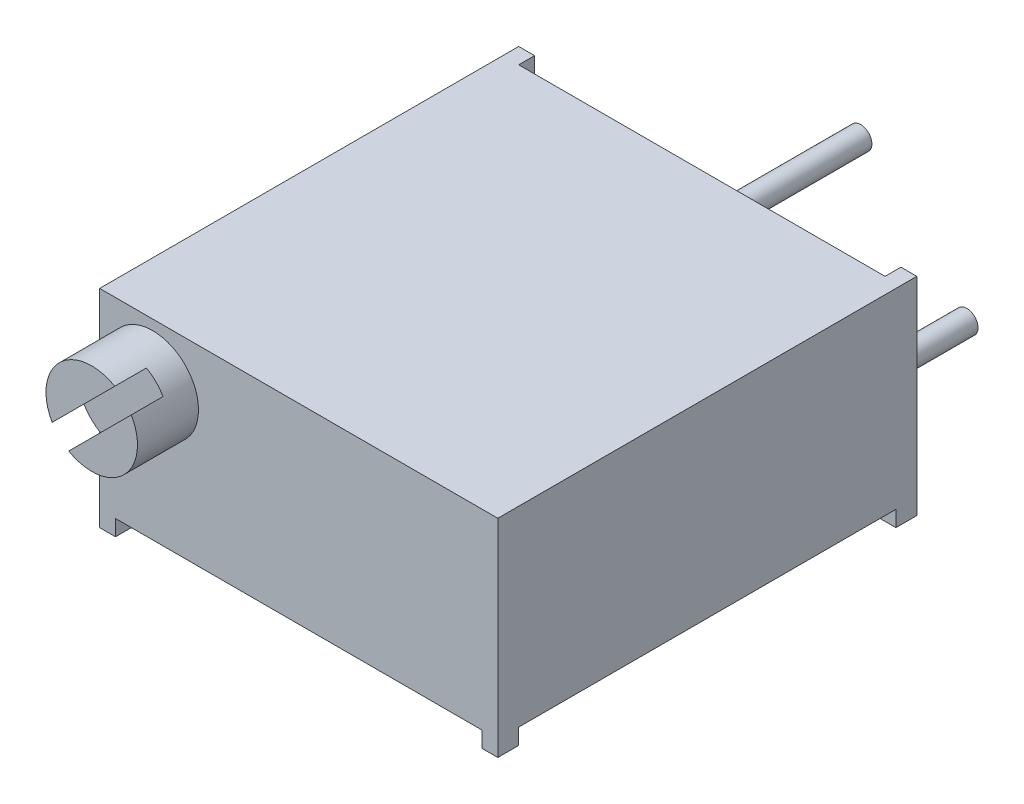
ISO-10303-21;
HEADER;
FILE_DESCRIPTION(('STEP AP214'),'2;1');
FILE_NAME('part.step','',(''),(''),'','','');
FILE_SCHEMA(('AUTOMOTIVE_DESIGN { 1 0 10303 214 1 1 1 1 }'));
ENDSEC;
DATA;
#1=APPLICATION_CONTEXT('core data for automotive mechanical design processes');
#2=APPLICATION_PROTOCOL_DEFINITION('international standard','automotive_design',2000,#1);
#3=PRODUCT_CONTEXT('',#1,'mechanical');
#4=PRODUCT('Part','Part','',(#3));
#5=PRODUCT_RELATED_PRODUCT_CATEGORY('part','',(#4));
#6=PRODUCT_DEFINITION_FORMATION('','',#4);
#7=PRODUCT_DEFINITION_CONTEXT('part definition',#1,'design');
#8=PRODUCT_DEFINITION('design','',#6,#7);
#9=PRODUCT_DEFINITION_SHAPE('','',#8);
#10=(LENGTH_UNIT() NAMED_UNIT(*) SI_UNIT(.MILLI.,.METRE.));
#11=(NAMED_UNIT(*) PLANE_ANGLE_UNIT() SI_UNIT($,.RADIAN.));
#12=(NAMED_UNIT(*) SI_UNIT($,.STERADIAN.) SOLID_ANGLE_UNIT());
#13=UNCERTAINTY_MEASURE_WITH_UNIT(LENGTH_MEASURE(1.E-05),#10,'distance_accuracy_value','');
#14=(GEOMETRIC_REPRESENTATION_CONTEXT(3) GLOBAL_UNCERTAINTY_ASSIGNED_CONTEXT((#13)) GLOBAL_UNIT_ASSIGNED_CONTEXT((#10,
#11,#12)) REPRESENTATION_CONTEXT('',''));
#15=CARTESIAN_POINT('',(0.,0.,0.));
#16=DIRECTION('',(0.,0.,1.));
#17=DIRECTION('',(1.,0.,0.));
#18=AXIS2_PLACEMENT_3D('',#15,#16,#17);
#19=CARTESIAN_POINT('',(-2.837,-1.567,-3.42));
#20=DIRECTION('',(0.,0.,1.));
#21=DIRECTION('',(1.,0.,0.));
#22=AXIS2_PLACEMENT_3D('',#19,#20,#21);
#23=PLANE('',#22);
#24=CARTESIAN_POINT('',(-2.54,-1.27,-3.42));
#25=DIRECTION('',(0.,0.,-1.));
#26=DIRECTION('',(-1.,0.,0.));
#27=AXIS2_PLACEMENT_3D('',#24,#25,#26);
#28=CIRCLE('',#27,0.27);
#29=CARTESIAN_POINT('',(-2.81,-1.27,-3.42));
#30=VERTEX_POINT('',#29);
#31=EDGE_CURVE('P0_E26',#30,#30,#28,.F.);
#32=ORIENTED_EDGE('',*,*,#31,.F.);
#33=EDGE_LOOP('',(#32));
#34=FACE_BOUND('',#33,.T.);
#35=ADVANCED_FACE('P0_F23',(#34),#23,.F.);
#36=CARTESIAN_POINT('',(-2.837,-1.567,0.38));
#37=DIRECTION('',(0.,0.,1.));
#38=DIRECTION('',(1.,0.,0.));
#39=AXIS2_PLACEMENT_3D('',#36,#37,#38);
#40=PLANE('',#39);
#41=CARTESIAN_POINT('',(-2.54,-1.27,0.38));
#42=DIRECTION('',(0.,0.,-1.));
#43=DIRECTION('',(-1.,0.,0.));
#44=AXIS2_PLACEMENT_3D('',#41,#42,#43);
#45=CIRCLE('',#44,0.27);
#46=CARTESIAN_POINT('',(-2.81,-1.27,0.38));
#47=VERTEX_POINT('',#46);
#48=EDGE_CURVE('P0_E12',#47,#47,#45,.T.);
#49=ORIENTED_EDGE('',*,*,#48,.F.);
#50=EDGE_LOOP('',(#49));
#51=FACE_BOUND('',#50,.T.);
#52=ADVANCED_FACE('P0_F38',(#51),#40,.T.);
#53=CARTESIAN_POINT('',(-2.54,-1.27,0.57));
#54=DIRECTION('',(0.,0.,-1.));
#55=DIRECTION('',(-1.,0.,0.));
#56=AXIS2_PLACEMENT_3D('',#53,#54,#55);
#57=CYLINDRICAL_SURFACE('',#56,0.27);
#58=ORIENTED_EDGE('',*,*,#31,.T.);
#59=EDGE_LOOP('',(#58));
#60=FACE_BOUND('',#59,.T.);
#61=ORIENTED_EDGE('',*,*,#48,.T.);
#62=EDGE_LOOP('',(#61));
#63=FACE_BOUND('',#62,.T.);
#64=ADVANCED_FACE('P0_F35',(#60,#63),#57,.T.);
#65=CLOSED_SHELL('',(#35,#52,#64));
#66=MANIFOLD_SOLID_BREP('P0_B1',#65);
#67=CARTESIAN_POINT('',(-4.487569568086,0.495781026712,11.49));
#68=DIRECTION('',(0.,0.,1.));
#69=DIRECTION('',(1.,0.,0.));
#70=AXIS2_PLACEMENT_3D('',#67,#68,#69);
#71=PLANE('',#70);
#72=DIRECTION('',(0.707106781186548,0.707106781186548,0.));
#73=VECTOR('',#72,1.);
#74=CARTESIAN_POINT('',(-4.516384169419,0.524595628045,11.49));
#75=LINE('',#74,#73);
#76=CARTESIAN_POINT('',(-2.94444965265297,2.09653014481103,11.49));
#77=VERTEX_POINT('',#76);
#78=CARTESIAN_POINT('',(-4.44153014481103,0.599449652652973,11.49));
#79=VERTEX_POINT('',#78);
#80=EDGE_CURVE('P1_E64',#77,#79,#75,.F.);
#81=ORIENTED_EDGE('',*,*,#80,.F.);
#82=CARTESIAN_POINT('',(-3.495,1.15,11.49));
#83=DIRECTION('',(0.,0.,1.));
#84=DIRECTION('',(1.,0.,0.));
#85=AXIS2_PLACEMENT_3D('',#82,#83,#84);
#86=CIRCLE('',#85,1.095);
#87=EDGE_CURVE('P1_E28',#77,#79,#86,.T.);
#88=ORIENTED_EDGE('',*,*,#87,.T.);
#89=EDGE_LOOP('',(#81,#88));
#90=FACE_BOUND('',#89,.T.);
#91=ADVANCED_FACE('P1_F25',(#90),#71,.T.);
#92=CARTESIAN_POINT('',(-4.516384169419,0.524595628045,11.528));
#93=DIRECTION('',(0.707106781186548,-0.707106781186548,0.));
#94=DIRECTION('',(0.707106781186548,0.707106781186548,0.));
#95=AXIS2_PLACEMENT_3D('',#92,#93,#94);
#96=PLANE('',#95);
#97=DIRECTION('',(-0.707106781186547,-0.707106781186548,0.));
#98=VECTOR('',#97,1.);
#99=CARTESIAN_POINT('',(-2.944449652653,2.096530144811,10.73));
#100=LINE('',#99,#98);
#101=CARTESIAN_POINT('',(-2.94444965265297,2.09653014481103,10.73));
#102=VERTEX_POINT('',#101);
#103=CARTESIAN_POINT('',(-4.44153014481103,0.599449652652973,10.73));
#104=VERTEX_POINT('',#103);
#105=EDGE_CURVE('P1_E84',#102,#104,#100,.T.);
#106=ORIENTED_EDGE('',*,*,#105,.F.);
#107=DIRECTION('',(0.,0.,1.));
#108=VECTOR('',#107,1.);
#109=CARTESIAN_POINT('',(-2.944449652653,2.096530144811,11.528));
#110=LINE('',#109,#108);
#111=EDGE_CURVE('P1_E74',#102,#77,#110,.T.);
#112=ORIENTED_EDGE('',*,*,#111,.T.);
#113=ORIENTED_EDGE('',*,*,#80,.T.);
#114=DIRECTION('',(0.,0.,1.));
#115=VECTOR('',#114,1.);
#116=CARTESIAN_POINT('',(-4.441530144811,0.599449652653001,11.528));
#117=LINE('',#116,#115);
#118=EDGE_CURVE('P1_E67',#79,#104,#117,.F.);
#119=ORIENTED_EDGE('',*,*,#118,.T.);
#120=EDGE_LOOP('',(#106,#112,#113,#119));
#121=FACE_BOUND('',#120,.T.);
#122=ADVANCED_FACE('P1_F76',(#121),#96,.T.);
#123=CARTESIAN_POINT('',(-3.495,-0.553420235878,10.73));
#124=DIRECTION('',(0.,0.,1.));
#125=DIRECTION('',(1.,0.,0.));
#126=AXIS2_PLACEMENT_3D('',#123,#124,#125);
#127=PLANE('',#126);
#128=DIRECTION('',(-0.707106781186548,-0.707106781186548,0.));
#129=VECTOR('',#128,1.);
#130=CARTESIAN_POINT('',(-4.120404371955,0.128615830581,10.73));
#131=LINE('',#130,#129);
#132=CARTESIAN_POINT('',(-2.54846985518897,1.70055034734703,10.73));
#133=VERTEX_POINT('',#132);
#134=CARTESIAN_POINT('',(-4.04555034734703,0.203469855188973,10.73));
#135=VERTEX_POINT('',#134);
#136=EDGE_CURVE('P1_E89',#133,#135,#131,.T.);
#137=ORIENTED_EDGE('',*,*,#136,.F.);
#138=CARTESIAN_POINT('',(-3.495,1.15,10.73));
#139=DIRECTION('',(0.,0.,1.));
#140=DIRECTION('',(1.,0.,0.));
#141=AXIS2_PLACEMENT_3D('',#138,#139,#140);
#142=CIRCLE('',#141,1.095);
#143=EDGE_CURVE('P1_E82',#133,#102,#142,.T.);
#144=ORIENTED_EDGE('',*,*,#143,.T.);
#145=ORIENTED_EDGE('',*,*,#105,.T.);
#146=CARTESIAN_POINT('',(-3.495,1.15,10.73));
#147=DIRECTION('',(0.,0.,1.));
#148=DIRECTION('',(1.,0.,0.));
#149=AXIS2_PLACEMENT_3D('',#146,#147,#148);
#150=CIRCLE('',#149,1.095);
#151=EDGE_CURVE('P1_E70',#104,#135,#150,.T.);
#152=ORIENTED_EDGE('',*,*,#151,.T.);
#153=EDGE_LOOP('',(#137,#144,#145,#152));
#154=FACE_BOUND('',#153,.T.);
#155=ADVANCED_FACE('P1_F102',(#154),#127,.T.);
#156=CARTESIAN_POINT('',(-4.120404371955,0.128615830581,10.692));
#157=DIRECTION('',(-0.707106781186548,0.707106781186548,0.));
#158=DIRECTION('',(-0.707106781186548,-0.707106781186548,0.));
#159=AXIS2_PLACEMENT_3D('',#156,#157,#158);
#160=PLANE('',#159);
#161=ORIENTED_EDGE('',*,*,#136,.T.);
#162=DIRECTION('',(0.,0.,1.));
#163=VECTOR('',#162,1.);
#164=CARTESIAN_POINT('',(-4.045550347347,0.203469855189,10.692));
#165=LINE('',#164,#163);
#166=CARTESIAN_POINT('',(-4.04555034734703,0.203469855188973,11.49));
#167=VERTEX_POINT('',#166);
#168=EDGE_CURVE('P1_E92',#135,#167,#165,.T.);
#169=ORIENTED_EDGE('',*,*,#168,.T.);
#170=DIRECTION('',(-0.707106781186547,-0.707106781186548,0.));
#171=VECTOR('',#170,1.);
#172=CARTESIAN_POINT('',(-2.548469855189,1.700550347347,11.49));
#173=LINE('',#172,#171);
#174=CARTESIAN_POINT('',(-2.54846985518897,1.70055034734703,11.49));
#175=VERTEX_POINT('',#174);
#176=EDGE_CURVE('P1_E81',#175,#167,#173,.T.);
#177=ORIENTED_EDGE('',*,*,#176,.F.);
#178=DIRECTION('',(0.,0.,1.));
#179=VECTOR('',#178,1.);
#180=CARTESIAN_POINT('',(-2.548469855189,1.700550347347,10.692));
#181=LINE('',#180,#179);
#182=EDGE_CURVE('P1_E43',#175,#133,#181,.F.);
#183=ORIENTED_EDGE('',*,*,#182,.T.);
#184=EDGE_LOOP('',(#161,#169,#177,#183));
#185=FACE_BOUND('',#184,.T.);
#186=ADVANCED_FACE('P1_F101',(#185),#160,.T.);
#187=CARTESIAN_POINT('',(-3.515297743954,-0.476490797419,11.49));
#188=DIRECTION('',(0.,0.,1.));
#189=DIRECTION('',(1.,0.,0.));
#190=AXIS2_PLACEMENT_3D('',#187,#188,#189);
#191=PLANE('',#190);
#192=ORIENTED_EDGE('',*,*,#176,.T.);
#193=CARTESIAN_POINT('',(-3.495,1.15,11.49));
#194=DIRECTION('',(0.,0.,1.));
#195=DIRECTION('',(1.,0.,0.));
#196=AXIS2_PLACEMENT_3D('',#193,#194,#195);
#197=CIRCLE('',#196,1.095);
#198=EDGE_CURVE('P1_E34',#175,#167,#197,.F.);
#199=ORIENTED_EDGE('',*,*,#198,.F.);
#200=EDGE_LOOP('',(#192,#199));
#201=FACE_BOUND('',#200,.T.);
#202=ADVANCED_FACE('P1_F99',(#201),#191,.T.);
#203=CARTESIAN_POINT('',(-3.495,-0.553420235878,9.97));
#204=DIRECTION('',(0.,0.,1.));
#205=DIRECTION('',(1.,0.,0.));
#206=AXIS2_PLACEMENT_3D('',#203,#204,#205);
#207=PLANE('',#206);
#208=CARTESIAN_POINT('',(-3.495,1.15,9.97));
#209=DIRECTION('',(0.,0.,1.));
#210=DIRECTION('',(1.,0.,0.));
#211=AXIS2_PLACEMENT_3D('',#208,#209,#210);
#212=CIRCLE('',#211,1.095);
#213=CARTESIAN_POINT('',(-2.4,1.15,9.97));
#214=VERTEX_POINT('',#213);
#215=EDGE_CURVE('P1_E13',#214,#214,#212,.T.);
#216=ORIENTED_EDGE('',*,*,#215,.F.);
#217=EDGE_LOOP('',(#216));
#218=FACE_BOUND('',#217,.T.);
#219=ADVANCED_FACE('P1_F112',(#218),#207,.F.);
#220=CARTESIAN_POINT('',(-3.495,1.15,10.692));
#221=DIRECTION('',(0.,0.,1.));
#222=DIRECTION('',(1.,0.,0.));
#223=AXIS2_PLACEMENT_3D('',#220,#221,#222);
#224=CYLINDRICAL_SURFACE('',#223,1.095);
#225=ORIENTED_EDGE('',*,*,#215,.T.);
#226=EDGE_LOOP('',(#225));
#227=FACE_BOUND('',#226,.T.);
#228=ORIENTED_EDGE('',*,*,#198,.T.);
#229=ORIENTED_EDGE('',*,*,#168,.F.);
#230=ORIENTED_EDGE('',*,*,#151,.F.);
#231=ORIENTED_EDGE('',*,*,#118,.F.);
#232=ORIENTED_EDGE('',*,*,#87,.F.);
#233=ORIENTED_EDGE('',*,*,#111,.F.);
#234=ORIENTED_EDGE('',*,*,#143,.F.);
#235=ORIENTED_EDGE('',*,*,#182,.F.);
#236=EDGE_LOOP('',(#228,#229,#230,#231,#232,#233,#234,#235));
#237=FACE_BOUND('',#236,.T.);
#238=ADVANCED_FACE('P1_F68',(#227,#237),#224,.T.);
#239=CLOSED_SHELL('',(#91,#122,#155,#186,#202,#219,#238));
#240=MANIFOLD_SOLID_BREP('P1_B1',#239);
#241=CARTESIAN_POINT('',(4.575,0.07000000000004,9.53));
#242=DIRECTION('',(0.,0.,1.));
#243=DIRECTION('',(1.,0.,0.));
#244=AXIS2_PLACEMENT_3D('',#241,#242,#243);
#245=PLANE('',#244);
#246=DIRECTION('',(0.,1.,0.));
#247=VECTOR('',#246,1.);
#248=CARTESIAN_POINT('',(4.765,-2.259,9.53));
#249=LINE('',#248,#247);
#250=CARTESIAN_POINT('',(4.765,-2.475,9.53));
#251=VERTEX_POINT('',#250);
#252=CARTESIAN_POINT('',(4.765,-2.095,9.53));
#253=VERTEX_POINT('',#252);
#254=EDGE_CURVE('P2_E152',#251,#253,#249,.T.);
#255=ORIENTED_EDGE('',*,*,#254,.F.);
#256=DIRECTION('',(1.,0.,0.));
#257=VECTOR('',#256,1.);
#258=CARTESIAN_POINT('',(4.575,-2.475,9.53));
#259=LINE('',#258,#257);
#260=CARTESIAN_POINT('',(4.385,-2.475,9.53));
#261=VERTEX_POINT('',#260);
#262=EDGE_CURVE('P2_E147',#261,#251,#259,.T.);
#263=ORIENTED_EDGE('',*,*,#262,.F.);
#264=DIRECTION('',(0.,1.,0.));
#265=VECTOR('',#264,1.);
#266=CARTESIAN_POINT('',(4.385,0.07000000000004,9.53));
#267=LINE('',#266,#265);
#268=CARTESIAN_POINT('',(4.385,-2.095,9.53));
#269=VERTEX_POINT('',#268);
#270=EDGE_CURVE('P2_E150',#261,#269,#267,.T.);
#271=ORIENTED_EDGE('',*,*,#270,.T.);
#272=DIRECTION('',(1.,0.,0.));
#273=VECTOR('',#272,1.);
#274=CARTESIAN_POINT('',(-5.2415,-2.095,9.53));
#275=LINE('',#274,#273);
#276=EDGE_CURVE('P2_E212',#253,#269,#275,.F.);
#277=ORIENTED_EDGE('',*,*,#276,.F.);
#278=EDGE_LOOP('',(#255,#263,#271,#277));
#279=FACE_BOUND('',#278,.T.);
#280=ADVANCED_FACE('P2_F17',(#279),#245,.F.);
#281=CARTESIAN_POINT('',(4.575,0.07000000000004,0.5));
#282=DIRECTION('',(0.,0.,-1.));
#283=DIRECTION('',(-1.,0.,0.));
#284=AXIS2_PLACEMENT_3D('',#281,#282,#283);
#285=PLANE('',#284);
#286=DIRECTION('',(0.,1.,0.));
#287=VECTOR('',#286,1.);
#288=CARTESIAN_POINT('',(4.385,0.07000000000004,0.5));
#289=LINE('',#288,#287);
#290=CARTESIAN_POINT('',(4.385,-2.095,0.5));
#291=VERTEX_POINT('',#290);
#292=CARTESIAN_POINT('',(4.385,-2.475,0.5));
#293=VERTEX_POINT('',#292);
#294=EDGE_CURVE('P2_E191',#291,#293,#289,.F.);
#295=ORIENTED_EDGE('',*,*,#294,.T.);
#296=DIRECTION('',(1.,0.,0.));
#297=VECTOR('',#296,1.);
#298=CARTESIAN_POINT('',(4.575,-2.475,0.5));
#299=LINE('',#298,#297);
#300=CARTESIAN_POINT('',(4.765,-2.475,0.5));
#301=VERTEX_POINT('',#300);
#302=EDGE_CURVE('P2_E21',#301,#293,#299,.F.);
#303=ORIENTED_EDGE('',*,*,#302,.F.);
#304=DIRECTION('',(0.,1.,0.));
#305=VECTOR('',#304,1.);
#306=CARTESIAN_POINT('',(4.765,-2.259,0.5));
#307=LINE('',#306,#305);
#308=CARTESIAN_POINT('',(4.765,-2.095,0.5));
#309=VERTEX_POINT('',#308);
#310=EDGE_CURVE('P2_E276',#309,#301,#307,.F.);
#311=ORIENTED_EDGE('',*,*,#310,.F.);
#312=DIRECTION('',(1.,0.,0.));
#313=VECTOR('',#312,1.);
#314=CARTESIAN_POINT('',(-5.2415,-2.095,0.5));
#315=LINE('',#314,#313);
#316=EDGE_CURVE('P2_E198',#291,#309,#315,.T.);
#317=ORIENTED_EDGE('',*,*,#316,.F.);
#318=EDGE_LOOP('',(#295,#303,#311,#317));
#319=FACE_BOUND('',#318,.T.);
#320=ADVANCED_FACE('P2_F197',(#319),#285,.F.);
#321=CARTESIAN_POINT('',(4.575,-2.475,0.25));
#322=DIRECTION('',(0.,-1.,0.));
#323=DIRECTION('',(0.,0.,-1.));
#324=AXIS2_PLACEMENT_3D('',#321,#322,#323);
#325=PLANE('',#324);
#326=DIRECTION('',(0.,0.,-1.));
#327=VECTOR('',#326,1.);
#328=CARTESIAN_POINT('',(4.765,-2.475,10.5125));
#329=LINE('',#328,#327);
#330=CARTESIAN_POINT('',(4.765,-2.475,0.));
#331=VERTEX_POINT('',#330);
#332=EDGE_CURVE('P2_E183',#301,#331,#329,.T.);
#333=ORIENTED_EDGE('',*,*,#332,.F.);
#334=ORIENTED_EDGE('',*,*,#302,.T.);
#335=DIRECTION('',(0.,0.,-1.));
#336=VECTOR('',#335,1.);
#337=CARTESIAN_POINT('',(4.385,-2.475,0.25));
#338=LINE('',#337,#336);
#339=CARTESIAN_POINT('',(4.385,-2.475,0.));
#340=VERTEX_POINT('',#339);
#341=EDGE_CURVE('P2_E182',#293,#340,#338,.T.);
#342=ORIENTED_EDGE('',*,*,#341,.T.);
#343=DIRECTION('',(1.,0.,0.));
#344=VECTOR('',#343,1.);
#345=CARTESIAN_POINT('',(4.575,-2.475,0.));
#346=LINE('',#345,#344);
#347=EDGE_CURVE('P2_E173',#340,#331,#346,.T.);
#348=ORIENTED_EDGE('',*,*,#347,.T.);
#349=EDGE_LOOP('',(#333,#334,#342,#348));
#350=FACE_BOUND('',#349,.T.);
#351=ADVANCED_FACE('P2_F181',(#350),#325,.T.);
#352=CARTESIAN_POINT('',(4.575,0.07000000000004,0.));
#353=DIRECTION('',(0.,0.,1.));
#354=DIRECTION('',(1.,0.,0.));
#355=AXIS2_PLACEMENT_3D('',#352,#353,#354);
#356=PLANE('',#355);
#357=DIRECTION('',(1.,0.,0.));
#358=VECTOR('',#357,1.);
#359=CARTESIAN_POINT('',(4.575,2.485,0.));
#360=LINE('',#359,#358);
#361=CARTESIAN_POINT('',(4.765,2.485,0.));
#362=VERTEX_POINT('',#361);
#363=CARTESIAN_POINT('',(4.385,2.485,0.));
#364=VERTEX_POINT('',#363);
#365=EDGE_CURVE('P2_E157',#362,#364,#360,.F.);
#366=ORIENTED_EDGE('',*,*,#365,.F.);
#367=DIRECTION('',(0.,1.,0.));
#368=VECTOR('',#367,1.);
#369=CARTESIAN_POINT('',(4.765,-2.259,0.));
#370=LINE('',#369,#368);
#371=EDGE_CURVE('P2_E272',#331,#362,#370,.T.);
#372=ORIENTED_EDGE('',*,*,#371,.F.);
#373=ORIENTED_EDGE('',*,*,#347,.F.);
#374=DIRECTION('',(0.,1.,0.));
#375=VECTOR('',#374,1.);
#376=CARTESIAN_POINT('',(4.385,0.07000000000004,0.));
#377=LINE('',#376,#375);
#378=EDGE_CURVE('P2_E195',#340,#364,#377,.T.);
#379=ORIENTED_EDGE('',*,*,#378,.T.);
#380=EDGE_LOOP('',(#366,#372,#373,#379));
#381=FACE_BOUND('',#380,.T.);
#382=ADVANCED_FACE('P2_F288',(#381),#356,.F.);
#383=CARTESIAN_POINT('',(4.575,-2.475,9.78));
#384=DIRECTION('',(0.,-1.,0.));
#385=DIRECTION('',(0.,0.,-1.));
#386=AXIS2_PLACEMENT_3D('',#383,#384,#385);
#387=PLANE('',#386);
#388=DIRECTION('',(0.,0.,-1.));
#389=VECTOR('',#388,1.);
#390=CARTESIAN_POINT('',(4.765,-2.475,10.5125));
#391=LINE('',#390,#389);
#392=CARTESIAN_POINT('',(4.765,-2.475,10.03));
#393=VERTEX_POINT('',#392);
#394=EDGE_CURVE('P2_E282',#393,#251,#391,.T.);
#395=ORIENTED_EDGE('',*,*,#394,.F.);
#396=DIRECTION('',(-1.,0.,0.));
#397=VECTOR('',#396,1.);
#398=CARTESIAN_POINT('',(0.,-2.475,10.03));
#399=LINE('',#398,#397);
#400=CARTESIAN_POINT('',(4.385,-2.475,10.03));
#401=VERTEX_POINT('',#400);
#402=EDGE_CURVE('P2_E169',#393,#401,#399,.T.);
#403=ORIENTED_EDGE('',*,*,#402,.T.);
#404=DIRECTION('',(0.,0.,-1.));
#405=VECTOR('',#404,1.);
#406=CARTESIAN_POINT('',(4.385,-2.475,9.78));
#407=LINE('',#406,#405);
#408=EDGE_CURVE('P2_E156',#401,#261,#407,.T.);
#409=ORIENTED_EDGE('',*,*,#408,.T.);
#410=ORIENTED_EDGE('',*,*,#262,.T.);
#411=EDGE_LOOP('',(#395,#403,#409,#410));
#412=FACE_BOUND('',#411,.T.);
#413=ADVANCED_FACE('P2_F167',(#412),#387,.T.);
#414=CARTESIAN_POINT('',(4.385,0.07000000000004,9.78));
#415=DIRECTION('',(1.,0.,0.));
#416=DIRECTION('',(0.,0.,-1.));
#417=AXIS2_PLACEMENT_3D('',#414,#415,#416);
#418=PLANE('',#417);
#419=ORIENTED_EDGE('',*,*,#270,.F.);
#420=ORIENTED_EDGE('',*,*,#408,.F.);
#421=DIRECTION('',(0.,1.,0.));
#422=VECTOR('',#421,1.);
#423=CARTESIAN_POINT('',(4.385,0.00500000000000001,10.03));
#424=LINE('',#423,#422);
#425=CARTESIAN_POINT('',(4.385,-2.095,10.03));
#426=VERTEX_POINT('',#425);
#427=EDGE_CURVE('P2_E266',#401,#426,#424,.T.);
#428=ORIENTED_EDGE('',*,*,#427,.T.);
#429=DIRECTION('',(0.,0.,-1.));
#430=VECTOR('',#429,1.);
#431=CARTESIAN_POINT('',(4.385,-2.095,10.5125));
#432=LINE('',#431,#430);
#433=EDGE_CURVE('P2_E163',#269,#426,#432,.F.);
#434=ORIENTED_EDGE('',*,*,#433,.F.);
#435=EDGE_LOOP('',(#419,#420,#428,#434));
#436=FACE_BOUND('',#435,.T.);
#437=ADVANCED_FACE('P2_F160',(#436),#418,.F.);
#438=CARTESIAN_POINT('',(-4.385,-2.095,9.53));
#439=DIRECTION('',(-1.,0.,0.));
#440=DIRECTION('',(0.,-1.,0.));
#441=AXIS2_PLACEMENT_3D('',#438,#439,#440);
#442=PLANE('',#441);
#443=DIRECTION('',(0.,-1.,0.));
#444=VECTOR('',#443,1.);
#445=CARTESIAN_POINT('',(-4.385,0.0049999999999998,10.03));
#446=LINE('',#445,#444);
#447=CARTESIAN_POINT('',(-4.385,-2.095,10.03));
#448=VERTEX_POINT('',#447);
#449=CARTESIAN_POINT('',(-4.385,-2.475,10.03));
#450=VERTEX_POINT('',#449);
#451=EDGE_CURVE('P2_E258',#448,#450,#446,.T.);
#452=ORIENTED_EDGE('',*,*,#451,.T.);
#453=DIRECTION('',(0.,0.,1.));
#454=VECTOR('',#453,1.);
#455=CARTESIAN_POINT('',(-4.385,-2.475,9.78));
#456=LINE('',#455,#454);
#457=CARTESIAN_POINT('',(-4.385,-2.475,9.53));
#458=VERTEX_POINT('',#457);
#459=EDGE_CURVE('P2_E141',#458,#450,#456,.T.);
#460=ORIENTED_EDGE('',*,*,#459,.F.);
#461=DIRECTION('',(0.,1.,0.));
#462=VECTOR('',#461,1.);
#463=CARTESIAN_POINT('',(-4.385,-2.285,9.53));
#464=LINE('',#463,#462);
#465=CARTESIAN_POINT('',(-4.385,-2.095,9.53));
#466=VERTEX_POINT('',#465);
#467=EDGE_CURVE('P2_E225',#458,#466,#464,.T.);
#468=ORIENTED_EDGE('',*,*,#467,.T.);
#469=DIRECTION('',(0.,0.,-1.));
#470=VECTOR('',#469,1.);
#471=CARTESIAN_POINT('',(-4.385,-2.095,10.5125));
#472=LINE('',#471,#470);
#473=EDGE_CURVE('P2_E209',#448,#466,#472,.T.);
#474=ORIENTED_EDGE('',*,*,#473,.F.);
#475=EDGE_LOOP('',(#452,#460,#468,#474));
#476=FACE_BOUND('',#475,.T.);
#477=ADVANCED_FACE('P2_F343',(#476),#442,.F.);
#478=CARTESIAN_POINT('',(-4.385,-2.095,0.5));
#479=DIRECTION('',(0.,0.,-1.));
#480=DIRECTION('',(0.,-1.,0.));
#481=AXIS2_PLACEMENT_3D('',#478,#479,#480);
#482=PLANE('',#481);
#483=DIRECTION('',(0.,-1.,0.));
#484=VECTOR('',#483,1.);
#485=CARTESIAN_POINT('',(-4.765,0.00499999999999958,0.5));
#486=LINE('',#485,#484);
#487=CARTESIAN_POINT('',(-4.765,-2.095,0.5));
#488=VERTEX_POINT('',#487);
#489=CARTESIAN_POINT('',(-4.765,-2.475,0.5));
#490=VERTEX_POINT('',#489);
#491=EDGE_CURVE('P2_E248',#488,#490,#486,.T.);
#492=ORIENTED_EDGE('',*,*,#491,.T.);
#493=DIRECTION('',(-1.,0.,0.));
#494=VECTOR('',#493,1.);
#495=CARTESIAN_POINT('',(-4.575,-2.475,0.5));
#496=LINE('',#495,#494);
#497=CARTESIAN_POINT('',(-4.385,-2.475,0.5));
#498=VERTEX_POINT('',#497);
#499=EDGE_CURVE('P2_E164',#498,#490,#496,.T.);
#500=ORIENTED_EDGE('',*,*,#499,.F.);
#501=DIRECTION('',(0.,1.,0.));
#502=VECTOR('',#501,1.);
#503=CARTESIAN_POINT('',(-4.385,0.0049999999999998,0.5));
#504=LINE('',#503,#502);
#505=CARTESIAN_POINT('',(-4.385,-2.095,0.5));
#506=VERTEX_POINT('',#505);
#507=EDGE_CURVE('P2_E215',#498,#506,#504,.T.);
#508=ORIENTED_EDGE('',*,*,#507,.T.);
#509=DIRECTION('',(1.,0.,0.));
#510=VECTOR('',#509,1.);
#511=CARTESIAN_POINT('',(-5.2415,-2.095,0.5));
#512=LINE('',#511,#510);
#513=EDGE_CURVE('P2_E202',#488,#506,#512,.T.);
#514=ORIENTED_EDGE('',*,*,#513,.F.);
#515=EDGE_LOOP('',(#492,#500,#508,#514));
#516=FACE_BOUND('',#515,.T.);
#517=ADVANCED_FACE('P2_F254',(#516),#482,.F.);
#518=CARTESIAN_POINT('',(-4.765,-2.475,0.));
#519=DIRECTION('',(0.,-1.,0.));
#520=DIRECTION('',(1.,0.,0.));
#521=AXIS2_PLACEMENT_3D('',#518,#519,#520);
#522=PLANE('',#521);
#523=DIRECTION('',(0.,0.,-1.));
#524=VECTOR('',#523,1.);
#525=CARTESIAN_POINT('',(-4.765,-2.475,5.015));
#526=LINE('',#525,#524);
#527=CARTESIAN_POINT('',(-4.765,-2.475,0.));
#528=VERTEX_POINT('',#527);
#529=EDGE_CURVE('P2_E238',#490,#528,#526,.T.);
#530=ORIENTED_EDGE('',*,*,#529,.T.);
#531=DIRECTION('',(1.,0.,0.));
#532=VECTOR('',#531,1.);
#533=CARTESIAN_POINT('',(-4.575,-2.475,0.));
#534=LINE('',#533,#532);
#535=CARTESIAN_POINT('',(-4.385,-2.475,0.));
#536=VERTEX_POINT('',#535);
#537=EDGE_CURVE('P2_E231',#528,#536,#534,.T.);
#538=ORIENTED_EDGE('',*,*,#537,.T.);
#539=DIRECTION('',(0.,0.,1.));
#540=VECTOR('',#539,1.);
#541=CARTESIAN_POINT('',(-4.385,-2.475,0.249999999999999));
#542=LINE('',#541,#540);
#543=EDGE_CURVE('P2_E218',#536,#498,#542,.T.);
#544=ORIENTED_EDGE('',*,*,#543,.T.);
#545=ORIENTED_EDGE('',*,*,#499,.T.);
#546=EDGE_LOOP('',(#530,#538,#544,#545));
#547=FACE_BOUND('',#546,.T.);
#548=ADVANCED_FACE('P2_F237',(#547),#522,.T.);
#549=CARTESIAN_POINT('',(-4.385,-2.475,0.));
#550=DIRECTION('',(0.,0.,1.));
#551=DIRECTION('',(0.,1.,0.));
#552=AXIS2_PLACEMENT_3D('',#549,#550,#551);
#553=PLANE('',#552);
#554=ORIENTED_EDGE('',*,*,#537,.F.);
#555=DIRECTION('',(0.,1.,0.));
#556=VECTOR('',#555,1.);
#557=CARTESIAN_POINT('',(-4.765,0.0049999999999998,0.));
#558=LINE('',#557,#556);
#559=CARTESIAN_POINT('',(-4.765,2.485,0.));
#560=VERTEX_POINT('',#559);
#561=EDGE_CURVE('P2_E252',#528,#560,#558,.T.);
#562=ORIENTED_EDGE('',*,*,#561,.T.);
#563=DIRECTION('',(-1.,0.,0.));
#564=VECTOR('',#563,1.);
#565=CARTESIAN_POINT('',(-4.575,2.485,0.));
#566=LINE('',#565,#564);
#567=CARTESIAN_POINT('',(-4.385,2.485,0.));
#568=VERTEX_POINT('',#567);
#569=EDGE_CURVE('P2_E233',#568,#560,#566,.T.);
#570=ORIENTED_EDGE('',*,*,#569,.F.);
#571=DIRECTION('',(0.,-1.,0.));
#572=VECTOR('',#571,1.);
#573=CARTESIAN_POINT('',(-4.385,0.0049999999999998,0.));
#574=LINE('',#573,#572);
#575=EDGE_CURVE('P2_E221',#568,#536,#574,.T.);
#576=ORIENTED_EDGE('',*,*,#575,.T.);
#577=EDGE_LOOP('',(#554,#562,#570,#576));
#578=FACE_BOUND('',#577,.T.);
#579=ADVANCED_FACE('P2_F321',(#578),#553,.F.);
#580=CARTESIAN_POINT('',(-4.765,-2.475,9.53));
#581=DIRECTION('',(0.,-1.,0.));
#582=DIRECTION('',(1.,0.,0.));
#583=AXIS2_PLACEMENT_3D('',#580,#581,#582);
#584=PLANE('',#583);
#585=DIRECTION('',(0.,0.,-1.));
#586=VECTOR('',#585,1.);
#587=CARTESIAN_POINT('',(-4.765,-2.475,5.015));
#588=LINE('',#587,#586);
#589=CARTESIAN_POINT('',(-4.765,-2.475,10.03));
#590=VERTEX_POINT('',#589);
#591=CARTESIAN_POINT('',(-4.765,-2.475,9.53));
#592=VERTEX_POINT('',#591);
#593=EDGE_CURVE('P2_E315',#590,#592,#588,.T.);
#594=ORIENTED_EDGE('',*,*,#593,.T.);
#595=DIRECTION('',(1.,0.,0.));
#596=VECTOR('',#595,1.);
#597=CARTESIAN_POINT('',(-4.575,-2.475,9.53));
#598=LINE('',#597,#596);
#599=EDGE_CURVE('P2_E227',#592,#458,#598,.T.);
#600=ORIENTED_EDGE('',*,*,#599,.T.);
#601=ORIENTED_EDGE('',*,*,#459,.T.);
#602=DIRECTION('',(-1.,0.,0.));
#603=VECTOR('',#602,1.);
#604=CARTESIAN_POINT('',(0.,-2.475,10.03));
#605=LINE('',#604,#603);
#606=EDGE_CURVE('P2_E256',#450,#590,#605,.T.);
#607=ORIENTED_EDGE('',*,*,#606,.T.);
#608=EDGE_LOOP('',(#594,#600,#601,#607));
#609=FACE_BOUND('',#608,.T.);
#610=ADVANCED_FACE('P2_F340',(#609),#584,.T.);
#611=CARTESIAN_POINT('',(-4.385,-2.475,9.53));
#612=DIRECTION('',(0.,0.,1.));
#613=DIRECTION('',(0.,1.,0.));
#614=AXIS2_PLACEMENT_3D('',#611,#612,#613);
#615=PLANE('',#614);
#616=ORIENTED_EDGE('',*,*,#467,.F.);
#617=ORIENTED_EDGE('',*,*,#599,.F.);
#618=DIRECTION('',(0.,1.,0.));
#619=VECTOR('',#618,1.);
#620=CARTESIAN_POINT('',(-4.765,0.0049999999999998,9.53));
#621=LINE('',#620,#619);
#622=CARTESIAN_POINT('',(-4.765,-2.095,9.53));
#623=VERTEX_POINT('',#622);
#624=EDGE_CURVE('P2_E312',#592,#623,#621,.T.);
#625=ORIENTED_EDGE('',*,*,#624,.T.);
#626=DIRECTION('',(1.,0.,0.));
#627=VECTOR('',#626,1.);
#628=CARTESIAN_POINT('',(-5.2415,-2.095,9.53));
#629=LINE('',#628,#627);
#630=EDGE_CURVE('P2_E207',#466,#623,#629,.F.);
#631=ORIENTED_EDGE('',*,*,#630,.F.);
#632=EDGE_LOOP('',(#616,#617,#625,#631));
#633=FACE_BOUND('',#632,.T.);
#634=ADVANCED_FACE('P2_F338',(#633),#615,.F.);
#635=CARTESIAN_POINT('',(-4.385,2.485,0.));
#636=DIRECTION('',(-1.,0.,0.));
#637=DIRECTION('',(0.,-1.,0.));
#638=AXIS2_PLACEMENT_3D('',#635,#636,#637);
#639=PLANE('',#638);
#640=DIRECTION('',(0.,0.,-1.));
#641=VECTOR('',#640,1.);
#642=CARTESIAN_POINT('',(-4.385,-2.095,10.5125));
#643=LINE('',#642,#641);
#644=CARTESIAN_POINT('',(-4.385,-2.095,0.38));
#645=VERTEX_POINT('',#644);
#646=EDGE_CURVE('P2_E200',#506,#645,#643,.T.);
#647=ORIENTED_EDGE('',*,*,#646,.F.);
#648=ORIENTED_EDGE('',*,*,#507,.F.);
#649=ORIENTED_EDGE('',*,*,#543,.F.);
#650=ORIENTED_EDGE('',*,*,#575,.F.);
#651=DIRECTION('',(0.,0.,-1.));
#652=VECTOR('',#651,1.);
#653=CARTESIAN_POINT('',(-4.385,2.485,0.249999999999999));
#654=LINE('',#653,#652);
#655=CARTESIAN_POINT('',(-4.385,2.485,0.38));
#656=VERTEX_POINT('',#655);
#657=EDGE_CURVE('P2_E36',#656,#568,#654,.T.);
#658=ORIENTED_EDGE('',*,*,#657,.F.);
#659=DIRECTION('',(0.,1.,0.));
#660=VECTOR('',#659,1.);
#661=CARTESIAN_POINT('',(-4.385,-2.259,0.38));
#662=LINE('',#661,#660);
#663=EDGE_CURVE('P2_E308',#656,#645,#662,.F.);
#664=ORIENTED_EDGE('',*,*,#663,.T.);
#665=EDGE_LOOP('',(#647,#648,#649,#650,#658,#664));
#666=FACE_BOUND('',#665,.T.);
#667=ADVANCED_FACE('P2_F335',(#666),#639,.F.);
#668=CARTESIAN_POINT('',(-5.2415,-2.095,10.5125));
#669=DIRECTION('',(0.,-1.,0.));
#670=DIRECTION('',(0.,0.,-1.));
#671=AXIS2_PLACEMENT_3D('',#668,#669,#670);
#672=PLANE('',#671);
#673=ORIENTED_EDGE('',*,*,#646,.T.);
#674=DIRECTION('',(1.,0.,0.));
#675=VECTOR('',#674,1.);
#676=CARTESIAN_POINT('',(-5.2415,-2.095,0.38));
#677=LINE('',#676,#675);
#678=CARTESIAN_POINT('',(4.385,-2.095,0.38));
#679=VERTEX_POINT('',#678);
#680=EDGE_CURVE('P2_E302',#645,#679,#677,.T.);
#681=ORIENTED_EDGE('',*,*,#680,.T.);
#682=DIRECTION('',(0.,0.,-1.));
#683=VECTOR('',#682,1.);
#684=CARTESIAN_POINT('',(4.385,-2.095,0.25));
#685=LINE('',#684,#683);
#686=EDGE_CURVE('P2_E284',#679,#291,#685,.F.);
#687=ORIENTED_EDGE('',*,*,#686,.T.);
#688=ORIENTED_EDGE('',*,*,#316,.T.);
#689=DIRECTION('',(0.,0.,-1.));
#690=VECTOR('',#689,1.);
#691=CARTESIAN_POINT('',(4.765,-2.095,10.5125));
#692=LINE('',#691,#690);
#693=EDGE_CURVE('P2_E278',#253,#309,#692,.T.);
#694=ORIENTED_EDGE('',*,*,#693,.F.);
#695=ORIENTED_EDGE('',*,*,#276,.T.);
#696=ORIENTED_EDGE('',*,*,#433,.T.);
#697=DIRECTION('',(-1.,0.,0.));
#698=VECTOR('',#697,1.);
#699=CARTESIAN_POINT('',(0.,-2.095,10.03));
#700=LINE('',#699,#698);
#701=EDGE_CURVE('P2_E263',#426,#448,#700,.T.);
#702=ORIENTED_EDGE('',*,*,#701,.T.);
#703=ORIENTED_EDGE('',*,*,#473,.T.);
#704=ORIENTED_EDGE('',*,*,#630,.T.);
#705=DIRECTION('',(0.,0.,-1.));
#706=VECTOR('',#705,1.);
#707=CARTESIAN_POINT('',(-4.765,-2.095,5.015));
#708=LINE('',#707,#706);
#709=EDGE_CURVE('P2_E310',#623,#488,#708,.T.);
#710=ORIENTED_EDGE('',*,*,#709,.T.);
#711=ORIENTED_EDGE('',*,*,#513,.T.);
#712=EDGE_LOOP('',(#673,#681,#687,#688,#694,#695,#696,#702,#703,#704,#710,#711));
#713=FACE_BOUND('',#712,.T.);
#714=ADVANCED_FACE('P2_F328',(#713),#672,.T.);
#715=CARTESIAN_POINT('',(4.385,0.07000000000004,0.25));
#716=DIRECTION('',(1.,0.,0.));
#717=DIRECTION('',(0.,0.,-1.));
#718=AXIS2_PLACEMENT_3D('',#715,#716,#717);
#719=PLANE('',#718);
#720=DIRECTION('',(0.,1.,0.));
#721=VECTOR('',#720,1.);
#722=CARTESIAN_POINT('',(4.385,-2.259,0.38));
#723=LINE('',#722,#721);
#724=CARTESIAN_POINT('',(4.385,2.485,0.38));
#725=VERTEX_POINT('',#724);
#726=EDGE_CURVE('P2_E299',#679,#725,#723,.T.);
#727=ORIENTED_EDGE('',*,*,#726,.T.);
#728=DIRECTION('',(0.,0.,-1.));
#729=VECTOR('',#728,1.);
#730=CARTESIAN_POINT('',(4.385,2.485,0.25));
#731=LINE('',#730,#729);
#732=EDGE_CURVE('P2_E286',#364,#725,#731,.F.);
#733=ORIENTED_EDGE('',*,*,#732,.F.);
#734=ORIENTED_EDGE('',*,*,#378,.F.);
#735=ORIENTED_EDGE('',*,*,#341,.F.);
#736=ORIENTED_EDGE('',*,*,#294,.F.);
#737=ORIENTED_EDGE('',*,*,#686,.F.);
#738=EDGE_LOOP('',(#727,#733,#734,#735,#736,#737));
#739=FACE_BOUND('',#738,.T.);
#740=ADVANCED_FACE('P2_F190',(#739),#719,.F.);
#741=CARTESIAN_POINT('',(4.765,-2.259,10.5125));
#742=DIRECTION('',(1.,0.,0.));
#743=DIRECTION('',(0.,0.,-1.));
#744=AXIS2_PLACEMENT_3D('',#741,#742,#743);
#745=PLANE('',#744);
#746=ORIENTED_EDGE('',*,*,#332,.T.);
#747=ORIENTED_EDGE('',*,*,#371,.T.);
#748=DIRECTION('',(0.,0.,1.));
#749=VECTOR('',#748,1.);
#750=CARTESIAN_POINT('',(4.765,2.485,5.015));
#751=LINE('',#750,#749);
#752=CARTESIAN_POINT('',(4.765,2.485,10.03));
#753=VERTEX_POINT('',#752);
#754=EDGE_CURVE('P2_E293',#362,#753,#751,.T.);
#755=ORIENTED_EDGE('',*,*,#754,.T.);
#756=DIRECTION('',(0.,-1.,0.));
#757=VECTOR('',#756,1.);
#758=CARTESIAN_POINT('',(4.765,0.0049999999999998,10.03));
#759=LINE('',#758,#757);
#760=EDGE_CURVE('P2_E269',#753,#393,#759,.T.);
#761=ORIENTED_EDGE('',*,*,#760,.T.);
#762=ORIENTED_EDGE('',*,*,#394,.T.);
#763=ORIENTED_EDGE('',*,*,#254,.T.);
#764=ORIENTED_EDGE('',*,*,#693,.T.);
#765=ORIENTED_EDGE('',*,*,#310,.T.);
#766=EDGE_LOOP('',(#746,#747,#755,#761,#762,#763,#764,#765));
#767=FACE_BOUND('',#766,.T.);
#768=ADVANCED_FACE('P2_F292',(#767),#745,.T.);
#769=CARTESIAN_POINT('',(4.765,2.485,10.03));
#770=DIRECTION('',(0.,0.,-1.));
#771=DIRECTION('',(0.,-1.,0.));
#772=AXIS2_PLACEMENT_3D('',#769,#770,#771);
#773=PLANE('',#772);
#774=DIRECTION('',(0.,-1.,0.));
#775=VECTOR('',#774,1.);
#776=CARTESIAN_POINT('',(-4.765,0.0049999999999998,10.03));
#777=LINE('',#776,#775);
#778=CARTESIAN_POINT('',(-4.765,2.485,10.03));
#779=VERTEX_POINT('',#778);
#780=EDGE_CURVE('P2_E318',#779,#590,#777,.T.);
#781=ORIENTED_EDGE('',*,*,#780,.T.);
#782=ORIENTED_EDGE('',*,*,#606,.F.);
#783=ORIENTED_EDGE('',*,*,#451,.F.);
#784=ORIENTED_EDGE('',*,*,#701,.F.);
#785=ORIENTED_EDGE('',*,*,#427,.F.);
#786=ORIENTED_EDGE('',*,*,#402,.F.);
#787=ORIENTED_EDGE('',*,*,#760,.F.);
#788=DIRECTION('',(-1.,0.,0.));
#789=VECTOR('',#788,1.);
#790=CARTESIAN_POINT('',(0.,2.485,10.03));
#791=LINE('',#790,#789);
#792=EDGE_CURVE('P2_E298',#753,#779,#791,.T.);
#793=ORIENTED_EDGE('',*,*,#792,.T.);
#794=EDGE_LOOP('',(#781,#782,#783,#784,#785,#786,#787,#793));
#795=FACE_BOUND('',#794,.T.);
#796=ADVANCED_FACE('P2_F324',(#795),#773,.F.);
#797=CARTESIAN_POINT('',(-4.765,-2.475,0.));
#798=DIRECTION('',(1.,0.,0.));
#799=DIRECTION('',(0.,1.,0.));
#800=AXIS2_PLACEMENT_3D('',#797,#798,#799);
#801=PLANE('',#800);
#802=ORIENTED_EDGE('',*,*,#624,.F.);
#803=ORIENTED_EDGE('',*,*,#593,.F.);
#804=ORIENTED_EDGE('',*,*,#780,.F.);
#805=DIRECTION('',(0.,0.,-1.));
#806=VECTOR('',#805,1.);
#807=CARTESIAN_POINT('',(-4.765,2.485,5.015));
#808=LINE('',#807,#806);
#809=EDGE_CURVE('P2_E27',#779,#560,#808,.T.);
#810=ORIENTED_EDGE('',*,*,#809,.T.);
#811=ORIENTED_EDGE('',*,*,#561,.F.);
#812=ORIENTED_EDGE('',*,*,#529,.F.);
#813=ORIENTED_EDGE('',*,*,#491,.F.);
#814=ORIENTED_EDGE('',*,*,#709,.F.);
#815=EDGE_LOOP('',(#802,#803,#804,#810,#811,#812,#813,#814));
#816=FACE_BOUND('',#815,.T.);
#817=ADVANCED_FACE('P2_F246',(#816),#801,.F.);
#818=CARTESIAN_POINT('',(-5.2415,-2.259,0.38));
#819=DIRECTION('',(0.,0.,1.));
#820=DIRECTION('',(1.,0.,0.));
#821=AXIS2_PLACEMENT_3D('',#818,#819,#820);
#822=PLANE('',#821);
#823=ORIENTED_EDGE('',*,*,#680,.F.);
#824=ORIENTED_EDGE('',*,*,#663,.F.);
#825=DIRECTION('',(1.,0.,0.));
#826=VECTOR('',#825,1.);
#827=CARTESIAN_POINT('',(0.,2.485,0.38));
#828=LINE('',#827,#826);
#829=EDGE_CURVE('P2_E11',#656,#725,#828,.T.);
#830=ORIENTED_EDGE('',*,*,#829,.T.);
#831=ORIENTED_EDGE('',*,*,#726,.F.);
#832=EDGE_LOOP('',(#823,#824,#830,#831));
#833=FACE_BOUND('',#832,.T.);
#834=ADVANCED_FACE('P2_F332',(#833),#822,.F.);
#835=CARTESIAN_POINT('',(-4.765,2.485,0.));
#836=DIRECTION('',(0.,-1.,0.));
#837=DIRECTION('',(1.,0.,0.));
#838=AXIS2_PLACEMENT_3D('',#835,#836,#837);
#839=PLANE('',#838);
#840=ORIENTED_EDGE('',*,*,#657,.T.);
#841=ORIENTED_EDGE('',*,*,#569,.T.);
#842=ORIENTED_EDGE('',*,*,#809,.F.);
#843=ORIENTED_EDGE('',*,*,#792,.F.);
#844=ORIENTED_EDGE('',*,*,#754,.F.);
#845=ORIENTED_EDGE('',*,*,#365,.T.);
#846=ORIENTED_EDGE('',*,*,#732,.T.);
#847=ORIENTED_EDGE('',*,*,#829,.F.);
#848=EDGE_LOOP('',(#840,#841,#842,#843,#844,#845,#846,#847));
#849=FACE_BOUND('',#848,.T.);
#850=ADVANCED_FACE('P2_F19',(#849),#839,.F.);
#851=CLOSED_SHELL('',(#280,#320,#351,#382,#413,#437,#477,#517,#548,#579,#610,#634,#667,#714,
#740,#768,#796,#817,#834,#850));
#852=MANIFOLD_SOLID_BREP('P2_B1',#851);
#853=CARTESIAN_POINT('',(-0.297,0.973,-3.42));
#854=DIRECTION('',(0.,0.,1.));
#855=DIRECTION('',(1.,0.,0.));
#856=AXIS2_PLACEMENT_3D('',#853,#854,#855);
#857=PLANE('',#856);
#858=CARTESIAN_POINT('',(0.,1.27,-3.42));
#859=DIRECTION('',(0.,0.,-1.));
#860=DIRECTION('',(-1.,0.,0.));
#861=AXIS2_PLACEMENT_3D('',#858,#859,#860);
#862=CIRCLE('',#861,0.27);
#863=CARTESIAN_POINT('',(-0.27,1.27,-3.42));
#864=VERTEX_POINT('',#863);
#865=EDGE_CURVE('P3_E26',#864,#864,#862,.F.);
#866=ORIENTED_EDGE('',*,*,#865,.F.);
#867=EDGE_LOOP('',(#866));
#868=FACE_BOUND('',#867,.T.);
#869=ADVANCED_FACE('P3_F23',(#868),#857,.F.);
#870=CARTESIAN_POINT('',(-0.297,0.973,0.38));
#871=DIRECTION('',(0.,0.,1.));
#872=DIRECTION('',(1.,0.,0.));
#873=AXIS2_PLACEMENT_3D('',#870,#871,#872);
#874=PLANE('',#873);
#875=CARTESIAN_POINT('',(0.,1.27,0.38));
#876=DIRECTION('',(0.,0.,-1.));
#877=DIRECTION('',(-1.,0.,0.));
#878=AXIS2_PLACEMENT_3D('',#875,#876,#877);
#879=CIRCLE('',#878,0.27);
#880=CARTESIAN_POINT('',(-0.27,1.27,0.38));
#881=VERTEX_POINT('',#880);
#882=EDGE_CURVE('P3_E12',#881,#881,#879,.T.);
#883=ORIENTED_EDGE('',*,*,#882,.F.);
#884=EDGE_LOOP('',(#883));
#885=FACE_BOUND('',#884,.T.);
#886=ADVANCED_FACE('P3_F38',(#885),#874,.T.);
#887=CARTESIAN_POINT('',(0.,1.27,0.57));
#888=DIRECTION('',(0.,0.,-1.));
#889=DIRECTION('',(-1.,0.,0.));
#890=AXIS2_PLACEMENT_3D('',#887,#888,#889);
#891=CYLINDRICAL_SURFACE('',#890,0.27);
#892=ORIENTED_EDGE('',*,*,#865,.T.);
#893=EDGE_LOOP('',(#892));
#894=FACE_BOUND('',#893,.T.);
#895=ORIENTED_EDGE('',*,*,#882,.T.);
#896=EDGE_LOOP('',(#895));
#897=FACE_BOUND('',#896,.T.);
#898=ADVANCED_FACE('P3_F35',(#894,#897),#891,.T.);
#899=CLOSED_SHELL('',(#869,#886,#898));
#900=MANIFOLD_SOLID_BREP('P3_B1',#899);
#901=CARTESIAN_POINT('',(2.243,-1.567,-3.42));
#902=DIRECTION('',(0.,0.,1.));
#903=DIRECTION('',(1.,0.,0.));
#904=AXIS2_PLACEMENT_3D('',#901,#902,#903);
#905=PLANE('',#904);
#906=CARTESIAN_POINT('',(2.54,-1.27,-3.42));
#907=DIRECTION('',(0.,0.,-1.));
#908=DIRECTION('',(-1.,0.,0.));
#909=AXIS2_PLACEMENT_3D('',#906,#907,#908);
#910=CIRCLE('',#909,0.27);
#911=CARTESIAN_POINT('',(2.27,-1.27,-3.42));
#912=VERTEX_POINT('',#911);
#913=EDGE_CURVE('P4_E26',#912,#912,#910,.F.);
#914=ORIENTED_EDGE('',*,*,#913,.F.);
#915=EDGE_LOOP('',(#914));
#916=FACE_BOUND('',#915,.T.);
#917=ADVANCED_FACE('P4_F23',(#916),#905,.F.);
#918=CARTESIAN_POINT('',(2.243,-1.567,0.38));
#919=DIRECTION('',(0.,0.,1.));
#920=DIRECTION('',(1.,0.,0.));
#921=AXIS2_PLACEMENT_3D('',#918,#919,#920);
#922=PLANE('',#921);
#923=CARTESIAN_POINT('',(2.54,-1.27,0.38));
#924=DIRECTION('',(0.,0.,-1.));
#925=DIRECTION('',(-1.,0.,0.));
#926=AXIS2_PLACEMENT_3D('',#923,#924,#925);
#927=CIRCLE('',#926,0.27);
#928=CARTESIAN_POINT('',(2.27,-1.27,0.38));
#929=VERTEX_POINT('',#928);
#930=EDGE_CURVE('P4_E12',#929,#929,#927,.T.);
#931=ORIENTED_EDGE('',*,*,#930,.F.);
#932=EDGE_LOOP('',(#931));
#933=FACE_BOUND('',#932,.T.);
#934=ADVANCED_FACE('P4_F38',(#933),#922,.T.);
#935=CARTESIAN_POINT('',(2.54,-1.27,0.57));
#936=DIRECTION('',(0.,0.,-1.));
#937=DIRECTION('',(-1.,0.,0.));
#938=AXIS2_PLACEMENT_3D('',#935,#936,#937);
#939=CYLINDRICAL_SURFACE('',#938,0.27);
#940=ORIENTED_EDGE('',*,*,#913,.T.);
#941=EDGE_LOOP('',(#940));
#942=FACE_BOUND('',#941,.T.);
#943=ORIENTED_EDGE('',*,*,#930,.T.);
#944=EDGE_LOOP('',(#943));
#945=FACE_BOUND('',#944,.T.);
#946=ADVANCED_FACE('P4_F35',(#942,#945),#939,.T.);
#947=CLOSED_SHELL('',(#917,#934,#946));
#948=MANIFOLD_SOLID_BREP('P4_B1',#947);
#949=ADVANCED_BREP_SHAPE_REPRESENTATION('',(#18,#66,#240,#852,#900,#948),#14);
#950=SHAPE_DEFINITION_REPRESENTATION(#9,#949);
ENDSEC;
END-ISO-10303-21;
